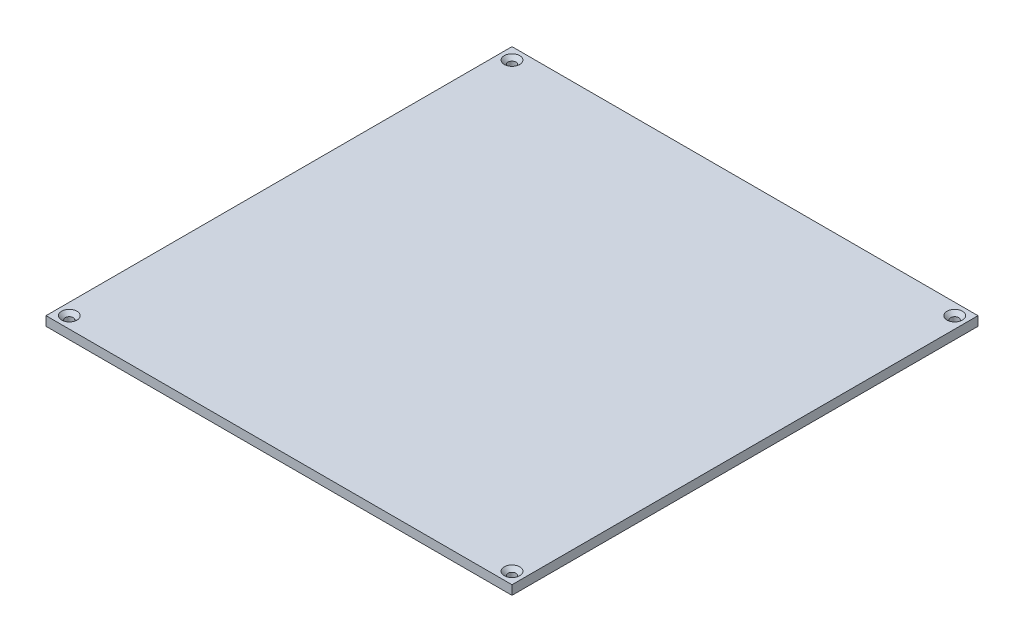
ISO-10303-21;
HEADER;
FILE_DESCRIPTION(('STEP AP214'),'2;1');
FILE_NAME('part.step','',(''),(''),'','','');
FILE_SCHEMA(('AUTOMOTIVE_DESIGN { 1 0 10303 214 1 1 1 1 }'));
ENDSEC;
DATA;
#1=APPLICATION_CONTEXT('core data for automotive mechanical design processes');
#2=APPLICATION_PROTOCOL_DEFINITION('international standard','automotive_design',2000,#1);
#3=PRODUCT_CONTEXT('',#1,'mechanical');
#4=PRODUCT('Part','Part','',(#3));
#5=PRODUCT_RELATED_PRODUCT_CATEGORY('part','',(#4));
#6=PRODUCT_DEFINITION_FORMATION('','',#4);
#7=PRODUCT_DEFINITION_CONTEXT('part definition',#1,'design');
#8=PRODUCT_DEFINITION('design','',#6,#7);
#9=PRODUCT_DEFINITION_SHAPE('','',#8);
#10=(LENGTH_UNIT() NAMED_UNIT(*) SI_UNIT(.MILLI.,.METRE.));
#11=(NAMED_UNIT(*) PLANE_ANGLE_UNIT() SI_UNIT($,.RADIAN.));
#12=(NAMED_UNIT(*) SI_UNIT($,.STERADIAN.) SOLID_ANGLE_UNIT());
#13=UNCERTAINTY_MEASURE_WITH_UNIT(LENGTH_MEASURE(1.E-05),#10,'distance_accuracy_value','');
#14=(GEOMETRIC_REPRESENTATION_CONTEXT(3) GLOBAL_UNCERTAINTY_ASSIGNED_CONTEXT((#13)) GLOBAL_UNIT_ASSIGNED_CONTEXT((#10,
#11,#12)) REPRESENTATION_CONTEXT('',''));
#15=CARTESIAN_POINT('',(0.,0.,0.));
#16=DIRECTION('',(0.,0.,1.));
#17=DIRECTION('',(1.,0.,0.));
#18=AXIS2_PLACEMENT_3D('',#15,#16,#17);
#19=CARTESIAN_POINT('',(-160.,-6.35000000000002,160.));
#20=DIRECTION('',(0.,0.,1.));
#21=DIRECTION('',(1.,0.,0.));
#22=AXIS2_PLACEMENT_3D('',#19,#20,#21);
#23=PLANE('',#22);
#24=DIRECTION('',(1.,0.,0.));
#25=VECTOR('',#24,1.);
#26=CARTESIAN_POINT('',(-160.,0.,160.));
#27=LINE('',#26,#25);
#28=CARTESIAN_POINT('',(-160.,0.,160.));
#29=VERTEX_POINT('',#28);
#30=CARTESIAN_POINT('',(160.,0.,160.));
#31=VERTEX_POINT('',#30);
#32=EDGE_CURVE('E117',#29,#31,#27,.T.);
#33=ORIENTED_EDGE('',*,*,#32,.F.);
#34=DIRECTION('',(0.,1.,0.));
#35=VECTOR('',#34,1.);
#36=CARTESIAN_POINT('',(-160.,-6.35000000000002,160.));
#37=LINE('',#36,#35);
#38=CARTESIAN_POINT('',(-160.,-6.35000000000002,160.));
#39=VERTEX_POINT('',#38);
#40=EDGE_CURVE('E13',#39,#29,#37,.T.);
#41=ORIENTED_EDGE('',*,*,#40,.F.);
#42=DIRECTION('',(1.,0.,0.));
#43=VECTOR('',#42,1.);
#44=CARTESIAN_POINT('',(-160.,-6.35000000000002,160.));
#45=LINE('',#44,#43);
#46=CARTESIAN_POINT('',(160.,-6.35000000000002,160.));
#47=VERTEX_POINT('',#46);
#48=EDGE_CURVE('E107',#39,#47,#45,.T.);
#49=ORIENTED_EDGE('',*,*,#48,.T.);
#50=DIRECTION('',(0.,1.,0.));
#51=VECTOR('',#50,1.);
#52=CARTESIAN_POINT('',(160.,-6.35000000000002,160.));
#53=LINE('',#52,#51);
#54=EDGE_CURVE('E51',#47,#31,#53,.T.);
#55=ORIENTED_EDGE('',*,*,#54,.T.);
#56=EDGE_LOOP('',(#33,#41,#49,#55));
#57=FACE_BOUND('',#56,.T.);
#58=ADVANCED_FACE('F48',(#57),#23,.T.);
#59=CARTESIAN_POINT('',(-160.,-6.35000000000002,-160.));
#60=DIRECTION('',(-1.,0.,0.));
#61=DIRECTION('',(0.,0.,1.));
#62=AXIS2_PLACEMENT_3D('',#59,#60,#61);
#63=PLANE('',#62);
#64=DIRECTION('',(0.,0.,1.));
#65=VECTOR('',#64,1.);
#66=CARTESIAN_POINT('',(-160.,0.,-160.));
#67=LINE('',#66,#65);
#68=CARTESIAN_POINT('',(-160.,0.,-160.));
#69=VERTEX_POINT('',#68);
#70=EDGE_CURVE('E112',#69,#29,#67,.T.);
#71=ORIENTED_EDGE('',*,*,#70,.F.);
#72=DIRECTION('',(0.,1.,0.));
#73=VECTOR('',#72,1.);
#74=CARTESIAN_POINT('',(-160.,-6.35000000000002,-160.));
#75=LINE('',#74,#73);
#76=CARTESIAN_POINT('',(-160.,-6.35000000000002,-160.));
#77=VERTEX_POINT('',#76);
#78=EDGE_CURVE('E57',#77,#69,#75,.T.);
#79=ORIENTED_EDGE('',*,*,#78,.F.);
#80=DIRECTION('',(0.,0.,1.));
#81=VECTOR('',#80,1.);
#82=CARTESIAN_POINT('',(-160.,-6.35000000000002,-160.));
#83=LINE('',#82,#81);
#84=EDGE_CURVE('E103',#77,#39,#83,.T.);
#85=ORIENTED_EDGE('',*,*,#84,.T.);
#86=ORIENTED_EDGE('',*,*,#40,.T.);
#87=EDGE_LOOP('',(#71,#79,#85,#86));
#88=FACE_BOUND('',#87,.T.);
#89=ADVANCED_FACE('F128',(#88),#63,.T.);
#90=CARTESIAN_POINT('',(160.,-6.35000000000002,-160.));
#91=DIRECTION('',(0.,0.,-1.));
#92=DIRECTION('',(-1.,0.,0.));
#93=AXIS2_PLACEMENT_3D('',#90,#91,#92);
#94=PLANE('',#93);
#95=DIRECTION('',(-1.,0.,0.));
#96=VECTOR('',#95,1.);
#97=CARTESIAN_POINT('',(160.,0.,-160.));
#98=LINE('',#97,#96);
#99=CARTESIAN_POINT('',(160.,0.,-160.));
#100=VERTEX_POINT('',#99);
#101=EDGE_CURVE('E98',#100,#69,#98,.T.);
#102=ORIENTED_EDGE('',*,*,#101,.F.);
#103=DIRECTION('',(0.,1.,0.));
#104=VECTOR('',#103,1.);
#105=CARTESIAN_POINT('',(160.,-6.35000000000002,-160.));
#106=LINE('',#105,#104);
#107=CARTESIAN_POINT('',(160.,-6.35000000000002,-160.));
#108=VERTEX_POINT('',#107);
#109=EDGE_CURVE('E93',#108,#100,#106,.T.);
#110=ORIENTED_EDGE('',*,*,#109,.F.);
#111=DIRECTION('',(-1.,0.,0.));
#112=VECTOR('',#111,1.);
#113=CARTESIAN_POINT('',(160.,-6.35000000000002,-160.));
#114=LINE('',#113,#112);
#115=EDGE_CURVE('E96',#108,#77,#114,.T.);
#116=ORIENTED_EDGE('',*,*,#115,.T.);
#117=ORIENTED_EDGE('',*,*,#78,.T.);
#118=EDGE_LOOP('',(#102,#110,#116,#117));
#119=FACE_BOUND('',#118,.T.);
#120=ADVANCED_FACE('F95',(#119),#94,.T.);
#121=CARTESIAN_POINT('',(160.,-6.35000000000002,160.));
#122=DIRECTION('',(1.,0.,0.));
#123=DIRECTION('',(0.,0.,-1.));
#124=AXIS2_PLACEMENT_3D('',#121,#122,#123);
#125=PLANE('',#124);
#126=DIRECTION('',(0.,0.,-1.));
#127=VECTOR('',#126,1.);
#128=CARTESIAN_POINT('',(160.,0.,160.));
#129=LINE('',#128,#127);
#130=EDGE_CURVE('E120',#31,#100,#129,.T.);
#131=ORIENTED_EDGE('',*,*,#130,.F.);
#132=ORIENTED_EDGE('',*,*,#54,.F.);
#133=DIRECTION('',(0.,0.,-1.));
#134=VECTOR('',#133,1.);
#135=CARTESIAN_POINT('',(160.,-6.35000000000002,160.));
#136=LINE('',#135,#134);
#137=EDGE_CURVE('E102',#47,#108,#136,.T.);
#138=ORIENTED_EDGE('',*,*,#137,.T.);
#139=ORIENTED_EDGE('',*,*,#109,.T.);
#140=EDGE_LOOP('',(#131,#132,#138,#139));
#141=FACE_BOUND('',#140,.T.);
#142=ADVANCED_FACE('F105',(#141),#125,.T.);
#143=CARTESIAN_POINT('',(0.,-6.35000000000002,0.));
#144=DIRECTION('',(0.,1.,0.));
#145=DIRECTION('',(0.,0.,1.));
#146=AXIS2_PLACEMENT_3D('',#143,#144,#145);
#147=PLANE('',#146);
#148=CARTESIAN_POINT('',(-152.,-6.35000000000002,-152.));
#149=DIRECTION('',(0.,1.,0.));
#150=DIRECTION('',(0.,0.,1.));
#151=AXIS2_PLACEMENT_3D('',#148,#149,#150);
#152=CIRCLE('',#151,2.75);
#153=CARTESIAN_POINT('',(-152.,-6.35000000000002,-149.25));
#154=VERTEX_POINT('',#153);
#155=EDGE_CURVE('E190',#154,#154,#152,.T.);
#156=ORIENTED_EDGE('',*,*,#155,.T.);
#157=EDGE_LOOP('',(#156));
#158=FACE_BOUND('',#157,.T.);
#159=CARTESIAN_POINT('',(152.,-6.35000000000002,-152.));
#160=DIRECTION('',(0.,1.,0.));
#161=DIRECTION('',(0.,0.,1.));
#162=AXIS2_PLACEMENT_3D('',#159,#160,#161);
#163=CIRCLE('',#162,2.75);
#164=CARTESIAN_POINT('',(152.,-6.35000000000002,-149.25));
#165=VERTEX_POINT('',#164);
#166=EDGE_CURVE('E200',#165,#165,#163,.T.);
#167=ORIENTED_EDGE('',*,*,#166,.T.);
#168=EDGE_LOOP('',(#167));
#169=FACE_BOUND('',#168,.T.);
#170=CARTESIAN_POINT('',(152.,-6.35000000000002,152.));
#171=DIRECTION('',(0.,1.,0.));
#172=DIRECTION('',(0.,0.,1.));
#173=AXIS2_PLACEMENT_3D('',#170,#171,#172);
#174=CIRCLE('',#173,2.75);
#175=CARTESIAN_POINT('',(152.,-6.35000000000002,154.75));
#176=VERTEX_POINT('',#175);
#177=EDGE_CURVE('E209',#176,#176,#174,.T.);
#178=ORIENTED_EDGE('',*,*,#177,.T.);
#179=EDGE_LOOP('',(#178));
#180=FACE_BOUND('',#179,.T.);
#181=CARTESIAN_POINT('',(-152.,-6.35000000000002,152.));
#182=DIRECTION('',(0.,1.,0.));
#183=DIRECTION('',(0.,0.,1.));
#184=AXIS2_PLACEMENT_3D('',#181,#182,#183);
#185=CIRCLE('',#184,2.75);
#186=CARTESIAN_POINT('',(-152.,-6.35000000000002,154.75));
#187=VERTEX_POINT('',#186);
#188=EDGE_CURVE('E121',#187,#187,#185,.T.);
#189=ORIENTED_EDGE('',*,*,#188,.T.);
#190=EDGE_LOOP('',(#189));
#191=FACE_BOUND('',#190,.T.);
#192=ORIENTED_EDGE('',*,*,#48,.F.);
#193=ORIENTED_EDGE('',*,*,#84,.F.);
#194=ORIENTED_EDGE('',*,*,#115,.F.);
#195=ORIENTED_EDGE('',*,*,#137,.F.);
#196=EDGE_LOOP('',(#192,#193,#194,#195));
#197=FACE_BOUND('',#196,.T.);
#198=ADVANCED_FACE('F101',(#158,#169,#180,#191,#197),#147,.F.);
#199=CARTESIAN_POINT('',(0.,0.,0.));
#200=DIRECTION('',(0.,1.,0.));
#201=DIRECTION('',(0.,0.,1.));
#202=AXIS2_PLACEMENT_3D('',#199,#200,#201);
#203=PLANE('',#202);
#204=CARTESIAN_POINT('',(-152.,0.,-152.));
#205=DIRECTION('',(0.,1.,0.));
#206=DIRECTION('',(0.,0.,1.));
#207=AXIS2_PLACEMENT_3D('',#204,#205,#206);
#208=CIRCLE('',#207,5.3);
#209=CARTESIAN_POINT('',(-152.,0.,-146.7));
#210=VERTEX_POINT('',#209);
#211=EDGE_CURVE('E188',#210,#210,#208,.T.);
#212=ORIENTED_EDGE('',*,*,#211,.F.);
#213=EDGE_LOOP('',(#212));
#214=FACE_BOUND('',#213,.T.);
#215=CARTESIAN_POINT('',(152.,0.,-152.));
#216=DIRECTION('',(0.,1.,0.));
#217=DIRECTION('',(0.,0.,1.));
#218=AXIS2_PLACEMENT_3D('',#215,#216,#217);
#219=CIRCLE('',#218,5.3);
#220=CARTESIAN_POINT('',(152.,0.,-146.7));
#221=VERTEX_POINT('',#220);
#222=EDGE_CURVE('E194',#221,#221,#219,.T.);
#223=ORIENTED_EDGE('',*,*,#222,.F.);
#224=EDGE_LOOP('',(#223));
#225=FACE_BOUND('',#224,.T.);
#226=CARTESIAN_POINT('',(152.,0.,152.));
#227=DIRECTION('',(0.,1.,0.));
#228=DIRECTION('',(0.,0.,1.));
#229=AXIS2_PLACEMENT_3D('',#226,#227,#228);
#230=CIRCLE('',#229,5.3);
#231=CARTESIAN_POINT('',(152.,0.,157.3));
#232=VERTEX_POINT('',#231);
#233=EDGE_CURVE('E203',#232,#232,#230,.T.);
#234=ORIENTED_EDGE('',*,*,#233,.F.);
#235=EDGE_LOOP('',(#234));
#236=FACE_BOUND('',#235,.T.);
#237=CARTESIAN_POINT('',(-152.,0.,152.));
#238=DIRECTION('',(0.,1.,0.));
#239=DIRECTION('',(0.,0.,1.));
#240=AXIS2_PLACEMENT_3D('',#237,#238,#239);
#241=CIRCLE('',#240,5.3);
#242=CARTESIAN_POINT('',(-152.,0.,157.3));
#243=VERTEX_POINT('',#242);
#244=EDGE_CURVE('E212',#243,#243,#241,.T.);
#245=ORIENTED_EDGE('',*,*,#244,.F.);
#246=EDGE_LOOP('',(#245));
#247=FACE_BOUND('',#246,.T.);
#248=ORIENTED_EDGE('',*,*,#32,.T.);
#249=ORIENTED_EDGE('',*,*,#130,.T.);
#250=ORIENTED_EDGE('',*,*,#101,.T.);
#251=ORIENTED_EDGE('',*,*,#70,.T.);
#252=EDGE_LOOP('',(#248,#249,#250,#251));
#253=FACE_BOUND('',#252,.T.);
#254=ADVANCED_FACE('F127',(#214,#225,#236,#247,#253),#203,.T.);
#255=CARTESIAN_POINT('',(-152.,0.,152.));
#256=DIRECTION('',(0.,1.,0.));
#257=DIRECTION('',(0.,0.,1.));
#258=AXIS2_PLACEMENT_3D('',#255,#256,#257);
#259=CYLINDRICAL_SURFACE('',#258,2.75);
#260=ORIENTED_EDGE('',*,*,#188,.F.);
#261=EDGE_LOOP('',(#260));
#262=FACE_BOUND('',#261,.T.);
#263=CARTESIAN_POINT('',(-152.,-2.55,152.));
#264=DIRECTION('',(0.,1.,0.));
#265=DIRECTION('',(0.,0.,1.));
#266=AXIS2_PLACEMENT_3D('',#263,#264,#265);
#267=CIRCLE('',#266,2.75);
#268=CARTESIAN_POINT('',(-152.,-2.55,154.75));
#269=VERTEX_POINT('',#268);
#270=EDGE_CURVE('E215',#269,#269,#267,.T.);
#271=ORIENTED_EDGE('',*,*,#270,.T.);
#272=EDGE_LOOP('',(#271));
#273=FACE_BOUND('',#272,.T.);
#274=ADVANCED_FACE('F145',(#262,#273),#259,.F.);
#275=CARTESIAN_POINT('',(-152.,0.,152.));
#276=DIRECTION('',(0.,1.,0.));
#277=DIRECTION('',(0.,0.,1.));
#278=AXIS2_PLACEMENT_3D('',#275,#276,#277);
#279=CONICAL_SURFACE('',#278,5.3,0.785398163397448);
#280=ORIENTED_EDGE('',*,*,#270,.F.);
#281=EDGE_LOOP('',(#280));
#282=FACE_BOUND('',#281,.T.);
#283=ORIENTED_EDGE('',*,*,#244,.T.);
#284=EDGE_LOOP('',(#283));
#285=FACE_BOUND('',#284,.T.);
#286=ADVANCED_FACE('F152',(#282,#285),#279,.F.);
#287=CARTESIAN_POINT('',(152.,0.,152.));
#288=DIRECTION('',(0.,1.,0.));
#289=DIRECTION('',(0.,0.,1.));
#290=AXIS2_PLACEMENT_3D('',#287,#288,#289);
#291=CYLINDRICAL_SURFACE('',#290,2.75);
#292=ORIENTED_EDGE('',*,*,#177,.F.);
#293=EDGE_LOOP('',(#292));
#294=FACE_BOUND('',#293,.T.);
#295=CARTESIAN_POINT('',(152.,-2.55,152.));
#296=DIRECTION('',(0.,1.,0.));
#297=DIRECTION('',(0.,0.,1.));
#298=AXIS2_PLACEMENT_3D('',#295,#296,#297);
#299=CIRCLE('',#298,2.75);
#300=CARTESIAN_POINT('',(152.,-2.55,154.75));
#301=VERTEX_POINT('',#300);
#302=EDGE_CURVE('E206',#301,#301,#299,.T.);
#303=ORIENTED_EDGE('',*,*,#302,.T.);
#304=EDGE_LOOP('',(#303));
#305=FACE_BOUND('',#304,.T.);
#306=ADVANCED_FACE('F156',(#294,#305),#291,.F.);
#307=CARTESIAN_POINT('',(152.,0.,152.));
#308=DIRECTION('',(0.,1.,0.));
#309=DIRECTION('',(0.,0.,1.));
#310=AXIS2_PLACEMENT_3D('',#307,#308,#309);
#311=CONICAL_SURFACE('',#310,5.3,0.785398163397448);
#312=ORIENTED_EDGE('',*,*,#302,.F.);
#313=EDGE_LOOP('',(#312));
#314=FACE_BOUND('',#313,.T.);
#315=ORIENTED_EDGE('',*,*,#233,.T.);
#316=EDGE_LOOP('',(#315));
#317=FACE_BOUND('',#316,.T.);
#318=ADVANCED_FACE('F160',(#314,#317),#311,.F.);
#319=CARTESIAN_POINT('',(152.,0.,-152.));
#320=DIRECTION('',(0.,1.,0.));
#321=DIRECTION('',(0.,0.,1.));
#322=AXIS2_PLACEMENT_3D('',#319,#320,#321);
#323=CYLINDRICAL_SURFACE('',#322,2.75);
#324=ORIENTED_EDGE('',*,*,#166,.F.);
#325=EDGE_LOOP('',(#324));
#326=FACE_BOUND('',#325,.T.);
#327=CARTESIAN_POINT('',(152.,-2.55,-152.));
#328=DIRECTION('',(0.,1.,0.));
#329=DIRECTION('',(0.,0.,1.));
#330=AXIS2_PLACEMENT_3D('',#327,#328,#329);
#331=CIRCLE('',#330,2.75);
#332=CARTESIAN_POINT('',(152.,-2.55,-149.25));
#333=VERTEX_POINT('',#332);
#334=EDGE_CURVE('E197',#333,#333,#331,.T.);
#335=ORIENTED_EDGE('',*,*,#334,.T.);
#336=EDGE_LOOP('',(#335));
#337=FACE_BOUND('',#336,.T.);
#338=ADVANCED_FACE('F164',(#326,#337),#323,.F.);
#339=CARTESIAN_POINT('',(152.,0.,-152.));
#340=DIRECTION('',(0.,1.,0.));
#341=DIRECTION('',(0.,0.,1.));
#342=AXIS2_PLACEMENT_3D('',#339,#340,#341);
#343=CONICAL_SURFACE('',#342,5.3,0.785398163397448);
#344=ORIENTED_EDGE('',*,*,#334,.F.);
#345=EDGE_LOOP('',(#344));
#346=FACE_BOUND('',#345,.T.);
#347=ORIENTED_EDGE('',*,*,#222,.T.);
#348=EDGE_LOOP('',(#347));
#349=FACE_BOUND('',#348,.T.);
#350=ADVANCED_FACE('F168',(#346,#349),#343,.F.);
#351=CARTESIAN_POINT('',(-152.,0.,-152.));
#352=DIRECTION('',(0.,1.,0.));
#353=DIRECTION('',(0.,0.,1.));
#354=AXIS2_PLACEMENT_3D('',#351,#352,#353);
#355=CYLINDRICAL_SURFACE('',#354,2.75);
#356=ORIENTED_EDGE('',*,*,#155,.F.);
#357=EDGE_LOOP('',(#356));
#358=FACE_BOUND('',#357,.T.);
#359=CARTESIAN_POINT('',(-152.,-2.55,-152.));
#360=DIRECTION('',(0.,1.,0.));
#361=DIRECTION('',(0.,0.,1.));
#362=AXIS2_PLACEMENT_3D('',#359,#360,#361);
#363=CIRCLE('',#362,2.75);
#364=CARTESIAN_POINT('',(-152.,-2.55,-149.25));
#365=VERTEX_POINT('',#364);
#366=EDGE_CURVE('E185',#365,#365,#363,.T.);
#367=ORIENTED_EDGE('',*,*,#366,.T.);
#368=EDGE_LOOP('',(#367));
#369=FACE_BOUND('',#368,.T.);
#370=ADVANCED_FACE('F172',(#358,#369),#355,.F.);
#371=CARTESIAN_POINT('',(-152.,0.,-152.));
#372=DIRECTION('',(0.,1.,0.));
#373=DIRECTION('',(0.,0.,1.));
#374=AXIS2_PLACEMENT_3D('',#371,#372,#373);
#375=CONICAL_SURFACE('',#374,5.3,0.785398163397448);
#376=ORIENTED_EDGE('',*,*,#366,.F.);
#377=EDGE_LOOP('',(#376));
#378=FACE_BOUND('',#377,.T.);
#379=ORIENTED_EDGE('',*,*,#211,.T.);
#380=EDGE_LOOP('',(#379));
#381=FACE_BOUND('',#380,.T.);
#382=ADVANCED_FACE('F176',(#378,#381),#375,.F.);
#383=CLOSED_SHELL('',(#58,#89,#120,#142,#198,#254,#274,#286,#306,#318,#338,#350,#370,#382));
#384=MANIFOLD_SOLID_BREP('B2',#383);
#385=ADVANCED_BREP_SHAPE_REPRESENTATION('',(#18,#384),#14);
#386=SHAPE_DEFINITION_REPRESENTATION(#9,#385);
ENDSEC;
END-ISO-10303-21;
